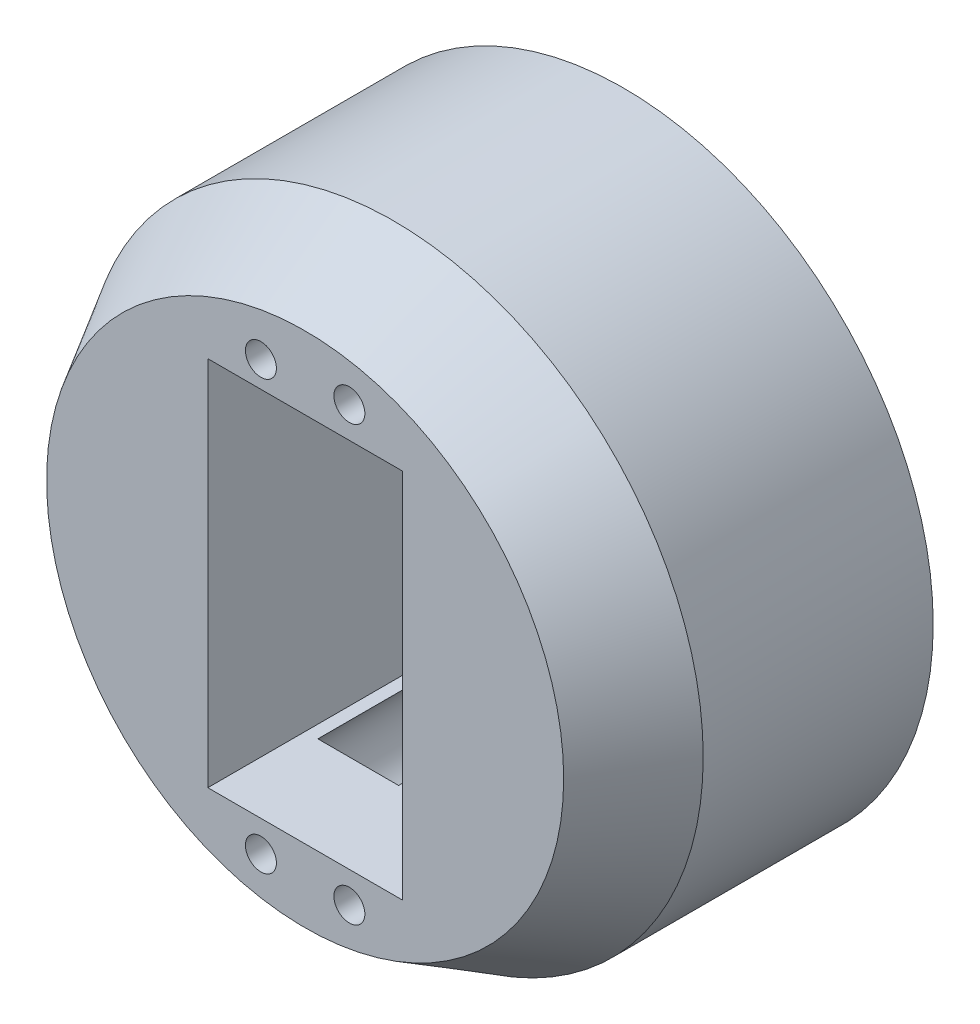
ISO-10303-21;
HEADER;
FILE_DESCRIPTION(('STEP AP214'),'2;1');
FILE_NAME('part.step','',(''),(''),'','','');
FILE_SCHEMA(('AUTOMOTIVE_DESIGN { 1 0 10303 214 1 1 1 1 }'));
ENDSEC;
DATA;
#1=APPLICATION_CONTEXT('core data for automotive mechanical design processes');
#2=APPLICATION_PROTOCOL_DEFINITION('international standard','automotive_design',2000,#1);
#3=PRODUCT_CONTEXT('',#1,'mechanical');
#4=PRODUCT('Part','Part','',(#3));
#5=PRODUCT_RELATED_PRODUCT_CATEGORY('part','',(#4));
#6=PRODUCT_DEFINITION_FORMATION('','',#4);
#7=PRODUCT_DEFINITION_CONTEXT('part definition',#1,'design');
#8=PRODUCT_DEFINITION('design','',#6,#7);
#9=PRODUCT_DEFINITION_SHAPE('','',#8);
#10=(LENGTH_UNIT() NAMED_UNIT(*) SI_UNIT(.MILLI.,.METRE.));
#11=(NAMED_UNIT(*) PLANE_ANGLE_UNIT() SI_UNIT($,.RADIAN.));
#12=(NAMED_UNIT(*) SI_UNIT($,.STERADIAN.) SOLID_ANGLE_UNIT());
#13=UNCERTAINTY_MEASURE_WITH_UNIT(LENGTH_MEASURE(1.E-05),#10,'distance_accuracy_value','');
#14=(GEOMETRIC_REPRESENTATION_CONTEXT(3) GLOBAL_UNCERTAINTY_ASSIGNED_CONTEXT((#13)) GLOBAL_UNIT_ASSIGNED_CONTEXT((#10,
#11,#12)) REPRESENTATION_CONTEXT('',''));
#15=CARTESIAN_POINT('',(0.,0.,0.));
#16=DIRECTION('',(0.,0.,1.));
#17=DIRECTION('',(1.,0.,0.));
#18=AXIS2_PLACEMENT_3D('',#15,#16,#17);
#19=CARTESIAN_POINT('',(0.,0.,0.));
#20=DIRECTION('',(0.,0.,1.));
#21=DIRECTION('',(1.,0.,0.));
#22=AXIS2_PLACEMENT_3D('',#19,#20,#21);
#23=PLANE('',#22);
#24=CARTESIAN_POINT('',(0.,0.,0.));
#25=DIRECTION('',(0.,0.,1.));
#26=DIRECTION('',(1.,0.,0.));
#27=AXIS2_PLACEMENT_3D('',#24,#25,#26);
#28=CIRCLE('',#27,35.);
#29=CARTESIAN_POINT('',(35.,0.,0.));
#30=VERTEX_POINT('',#29);
#31=EDGE_CURVE('E261',#30,#30,#28,.T.);
#32=ORIENTED_EDGE('',*,*,#31,.F.);
#33=EDGE_LOOP('',(#32));
#34=FACE_BOUND('',#33,.T.);
#35=DIRECTION('',(-1.,0.,0.));
#36=VECTOR('',#35,1.);
#37=CARTESIAN_POINT('',(-11.,21.,0.));
#38=LINE('',#37,#36);
#39=CARTESIAN_POINT('',(11.,21.,0.));
#40=VERTEX_POINT('',#39);
#41=CARTESIAN_POINT('',(9.56207189772367,21.,0.));
#42=VERTEX_POINT('',#41);
#43=EDGE_CURVE('E237',#40,#42,#38,.T.);
#44=ORIENTED_EDGE('',*,*,#43,.T.);
#45=CARTESIAN_POINT('',(5.,24.5,0.));
#46=DIRECTION('',(0.,0.,-1.));
#47=DIRECTION('',(-1.,0.,0.));
#48=AXIS2_PLACEMENT_3D('',#45,#46,#47);
#49=CIRCLE('',#48,5.75);
#50=CARTESIAN_POINT('',(-0.161572277524169,27.0339044228017,0.));
#51=VERTEX_POINT('',#50);
#52=EDGE_CURVE('E183',#51,#42,#49,.T.);
#53=ORIENTED_EDGE('',*,*,#52,.F.);
#54=CARTESIAN_POINT('',(-5.,23.9271187568155,0.));
#55=DIRECTION('',(0.,0.,-1.));
#56=DIRECTION('',(-1.,0.,0.));
#57=AXIS2_PLACEMENT_3D('',#54,#55,#56);
#58=CIRCLE('',#57,5.75);
#59=CARTESIAN_POINT('',(-9.94918940671085,21.,0.));
#60=VERTEX_POINT('',#59);
#61=EDGE_CURVE('E185',#60,#51,#58,.T.);
#62=ORIENTED_EDGE('',*,*,#61,.F.);
#63=CARTESIAN_POINT('',(-11.,21.,0.));
#64=VERTEX_POINT('',#63);
#65=EDGE_CURVE('E235',#60,#64,#38,.T.);
#66=ORIENTED_EDGE('',*,*,#65,.T.);
#67=DIRECTION('',(0.,-1.,0.));
#68=VECTOR('',#67,1.);
#69=CARTESIAN_POINT('',(-11.,-21.,0.));
#70=LINE('',#69,#68);
#71=CARTESIAN_POINT('',(-11.,-21.,0.));
#72=VERTEX_POINT('',#71);
#73=EDGE_CURVE('E240',#64,#72,#70,.T.);
#74=ORIENTED_EDGE('',*,*,#73,.T.);
#75=DIRECTION('',(1.,0.,0.));
#76=VECTOR('',#75,1.);
#77=CARTESIAN_POINT('',(-11.,-21.,0.));
#78=LINE('',#77,#76);
#79=CARTESIAN_POINT('',(-9.56207189772366,-21.,0.));
#80=VERTEX_POINT('',#79);
#81=EDGE_CURVE('E245',#72,#80,#78,.T.);
#82=ORIENTED_EDGE('',*,*,#81,.T.);
#83=CARTESIAN_POINT('',(-5.,-24.5,0.));
#84=DIRECTION('',(0.,0.,-1.));
#85=DIRECTION('',(-1.,0.,0.));
#86=AXIS2_PLACEMENT_3D('',#83,#84,#85);
#87=CIRCLE('',#86,5.75);
#88=CARTESIAN_POINT('',(0.,-27.3394541729001,0.));
#89=VERTEX_POINT('',#88);
#90=EDGE_CURVE('E201',#89,#80,#87,.T.);
#91=ORIENTED_EDGE('',*,*,#90,.F.);
#92=CARTESIAN_POINT('',(5.,-24.5,0.));
#93=DIRECTION('',(0.,0.,-1.));
#94=DIRECTION('',(-1.,0.,0.));
#95=AXIS2_PLACEMENT_3D('',#92,#93,#94);
#96=CIRCLE('',#95,5.75);
#97=CARTESIAN_POINT('',(9.56207189772367,-21.,0.));
#98=VERTEX_POINT('',#97);
#99=EDGE_CURVE('E200',#98,#89,#96,.T.);
#100=ORIENTED_EDGE('',*,*,#99,.F.);
#101=CARTESIAN_POINT('',(11.,-21.,0.));
#102=VERTEX_POINT('',#101);
#103=EDGE_CURVE('E244',#98,#102,#78,.T.);
#104=ORIENTED_EDGE('',*,*,#103,.T.);
#105=DIRECTION('',(0.,1.,0.));
#106=VECTOR('',#105,1.);
#107=CARTESIAN_POINT('',(11.,-21.,0.));
#108=LINE('',#107,#106);
#109=EDGE_CURVE('E232',#102,#40,#108,.T.);
#110=ORIENTED_EDGE('',*,*,#109,.T.);
#111=EDGE_LOOP('',(#44,#53,#62,#66,#74,#82,#91,#100,#104,#110));
#112=FACE_BOUND('',#111,.T.);
#113=ADVANCED_FACE('F43',(#34,#112),#23,.F.);
#114=CARTESIAN_POINT('',(0.161572277524159,21.3932143340138,0.));
#115=VERTEX_POINT('',#114);
#116=CARTESIAN_POINT('',(-0.0508105932891592,21.,0.));
#117=VERTEX_POINT('',#116);
#118=EDGE_CURVE('E164',#115,#117,#58,.T.);
#119=ORIENTED_EDGE('',*,*,#118,.F.);
#120=CARTESIAN_POINT('',(0.437928102276328,21.,0.));
#121=VERTEX_POINT('',#120);
#122=EDGE_CURVE('E170',#121,#115,#49,.T.);
#123=ORIENTED_EDGE('',*,*,#122,.F.);
#124=EDGE_CURVE('E241',#121,#117,#38,.T.);
#125=ORIENTED_EDGE('',*,*,#124,.T.);
#126=EDGE_LOOP('',(#119,#123,#125));
#127=FACE_BOUND('',#126,.T.);
#128=ADVANCED_FACE('F351',(#127),#23,.F.);
#129=CARTESIAN_POINT('',(-5.,23.9271187568155,0.));
#130=DIRECTION('',(0.,0.,1.));
#131=DIRECTION('',(1.,0.,0.));
#132=AXIS2_PLACEMENT_3D('',#129,#130,#131);
#133=CYLINDRICAL_SURFACE('',#132,1.75);
#134=CARTESIAN_POINT('',(-5.,23.9271187568155,36.));
#135=DIRECTION('',(0.,0.,1.));
#136=DIRECTION('',(1.,0.,0.));
#137=AXIS2_PLACEMENT_3D('',#134,#135,#136);
#138=CIRCLE('',#137,1.75);
#139=CARTESIAN_POINT('',(-3.25,23.9271187568155,36.));
#140=VERTEX_POINT('',#139);
#141=EDGE_CURVE('E222',#140,#140,#138,.T.);
#142=ORIENTED_EDGE('',*,*,#141,.T.);
#143=EDGE_LOOP('',(#142));
#144=FACE_BOUND('',#143,.T.);
#145=CARTESIAN_POINT('',(-5.,23.9271187568155,25.));
#146=DIRECTION('',(0.,0.,-1.));
#147=DIRECTION('',(-1.,0.,0.));
#148=AXIS2_PLACEMENT_3D('',#145,#146,#147);
#149=CIRCLE('',#148,1.75);
#150=CARTESIAN_POINT('',(-6.75,23.9271187568155,25.));
#151=VERTEX_POINT('',#150);
#152=EDGE_CURVE('E352',#151,#151,#149,.T.);
#153=ORIENTED_EDGE('',*,*,#152,.T.);
#154=EDGE_LOOP('',(#153));
#155=FACE_BOUND('',#154,.T.);
#156=ADVANCED_FACE('F375',(#144,#155),#133,.F.);
#157=CARTESIAN_POINT('',(5.,24.5,0.));
#158=DIRECTION('',(0.,0.,1.));
#159=DIRECTION('',(1.,0.,0.));
#160=AXIS2_PLACEMENT_3D('',#157,#158,#159);
#161=CYLINDRICAL_SURFACE('',#160,1.75);
#162=CARTESIAN_POINT('',(5.,24.5,36.));
#163=DIRECTION('',(0.,0.,1.));
#164=DIRECTION('',(1.,0.,0.));
#165=AXIS2_PLACEMENT_3D('',#162,#163,#164);
#166=CIRCLE('',#165,1.75);
#167=CARTESIAN_POINT('',(6.75,24.5,36.));
#168=VERTEX_POINT('',#167);
#169=EDGE_CURVE('E219',#168,#168,#166,.T.);
#170=ORIENTED_EDGE('',*,*,#169,.T.);
#171=EDGE_LOOP('',(#170));
#172=FACE_BOUND('',#171,.T.);
#173=CARTESIAN_POINT('',(5.,24.5,25.));
#174=DIRECTION('',(0.,0.,-1.));
#175=DIRECTION('',(-1.,0.,0.));
#176=AXIS2_PLACEMENT_3D('',#173,#174,#175);
#177=CIRCLE('',#176,1.75);
#178=CARTESIAN_POINT('',(3.25,24.5,25.));
#179=VERTEX_POINT('',#178);
#180=EDGE_CURVE('E214',#179,#179,#177,.T.);
#181=ORIENTED_EDGE('',*,*,#180,.T.);
#182=EDGE_LOOP('',(#181));
#183=FACE_BOUND('',#182,.T.);
#184=ADVANCED_FACE('F360',(#172,#183),#161,.F.);
#185=CARTESIAN_POINT('',(5.,-24.5,0.));
#186=DIRECTION('',(0.,0.,1.));
#187=DIRECTION('',(1.,0.,0.));
#188=AXIS2_PLACEMENT_3D('',#185,#186,#187);
#189=CYLINDRICAL_SURFACE('',#188,1.75);
#190=CARTESIAN_POINT('',(5.,-24.5,36.));
#191=DIRECTION('',(0.,0.,1.));
#192=DIRECTION('',(1.,0.,0.));
#193=AXIS2_PLACEMENT_3D('',#190,#191,#192);
#194=CIRCLE('',#193,1.75);
#195=CARTESIAN_POINT('',(6.75,-24.5,36.));
#196=VERTEX_POINT('',#195);
#197=EDGE_CURVE('E223',#196,#196,#194,.T.);
#198=ORIENTED_EDGE('',*,*,#197,.T.);
#199=EDGE_LOOP('',(#198));
#200=FACE_BOUND('',#199,.T.);
#201=CARTESIAN_POINT('',(5.,-24.5,25.));
#202=DIRECTION('',(0.,0.,-1.));
#203=DIRECTION('',(-1.,0.,0.));
#204=AXIS2_PLACEMENT_3D('',#201,#202,#203);
#205=CIRCLE('',#204,1.75);
#206=CARTESIAN_POINT('',(3.25,-24.5,25.));
#207=VERTEX_POINT('',#206);
#208=EDGE_CURVE('E203',#207,#207,#205,.T.);
#209=ORIENTED_EDGE('',*,*,#208,.T.);
#210=EDGE_LOOP('',(#209));
#211=FACE_BOUND('',#210,.T.);
#212=ADVANCED_FACE('F407',(#200,#211),#189,.F.);
#213=CARTESIAN_POINT('',(-5.,-24.5,0.));
#214=DIRECTION('',(0.,0.,1.));
#215=DIRECTION('',(1.,0.,0.));
#216=AXIS2_PLACEMENT_3D('',#213,#214,#215);
#217=CYLINDRICAL_SURFACE('',#216,1.75);
#218=CARTESIAN_POINT('',(-5.,-24.5,36.));
#219=DIRECTION('',(0.,0.,1.));
#220=DIRECTION('',(1.,0.,0.));
#221=AXIS2_PLACEMENT_3D('',#218,#219,#220);
#222=CIRCLE('',#221,1.75);
#223=CARTESIAN_POINT('',(-3.25,-24.5,36.));
#224=VERTEX_POINT('',#223);
#225=EDGE_CURVE('E226',#224,#224,#222,.T.);
#226=ORIENTED_EDGE('',*,*,#225,.T.);
#227=EDGE_LOOP('',(#226));
#228=FACE_BOUND('',#227,.T.);
#229=CARTESIAN_POINT('',(-5.,-24.5,25.));
#230=DIRECTION('',(0.,0.,-1.));
#231=DIRECTION('',(-1.,0.,0.));
#232=AXIS2_PLACEMENT_3D('',#229,#230,#231);
#233=CIRCLE('',#232,1.75);
#234=CARTESIAN_POINT('',(-6.75,-24.5,25.));
#235=VERTEX_POINT('',#234);
#236=EDGE_CURVE('E211',#235,#235,#233,.T.);
#237=ORIENTED_EDGE('',*,*,#236,.T.);
#238=EDGE_LOOP('',(#237));
#239=FACE_BOUND('',#238,.T.);
#240=ADVANCED_FACE('F389',(#228,#239),#217,.F.);
#241=CARTESIAN_POINT('',(0.,0.,36.));
#242=DIRECTION('',(0.,0.,-1.));
#243=DIRECTION('',(-1.,0.,0.));
#244=AXIS2_PLACEMENT_3D('',#241,#242,#243);
#245=CYLINDRICAL_SURFACE('',#244,35.);
#246=CARTESIAN_POINT('',(0.,0.,25.9999999999999));
#247=DIRECTION('',(0.,0.,1.));
#248=DIRECTION('',(1.,0.,0.));
#249=AXIS2_PLACEMENT_3D('',#246,#247,#248);
#250=CIRCLE('',#249,35.);
#251=CARTESIAN_POINT('',(35.,0.,25.9999999999999));
#252=VERTEX_POINT('',#251);
#253=EDGE_CURVE('E273',#252,#252,#250,.F.);
#254=ORIENTED_EDGE('',*,*,#253,.T.);
#255=EDGE_LOOP('',(#254));
#256=FACE_BOUND('',#255,.T.);
#257=ORIENTED_EDGE('',*,*,#31,.T.);
#258=EDGE_LOOP('',(#257));
#259=FACE_BOUND('',#258,.T.);
#260=ADVANCED_FACE('F384',(#256,#259),#245,.T.);
#261=CARTESIAN_POINT('',(0.,0.,36.));
#262=DIRECTION('',(0.,0.,1.));
#263=DIRECTION('',(1.,0.,0.));
#264=AXIS2_PLACEMENT_3D('',#261,#262,#263);
#265=PLANE('',#264);
#266=ORIENTED_EDGE('',*,*,#225,.F.);
#267=EDGE_LOOP('',(#266));
#268=FACE_BOUND('',#267,.T.);
#269=ORIENTED_EDGE('',*,*,#197,.F.);
#270=EDGE_LOOP('',(#269));
#271=FACE_BOUND('',#270,.T.);
#272=ORIENTED_EDGE('',*,*,#169,.F.);
#273=EDGE_LOOP('',(#272));
#274=FACE_BOUND('',#273,.T.);
#275=ORIENTED_EDGE('',*,*,#141,.F.);
#276=EDGE_LOOP('',(#275));
#277=FACE_BOUND('',#276,.T.);
#278=DIRECTION('',(0.,1.,0.));
#279=VECTOR('',#278,1.);
#280=CARTESIAN_POINT('',(11.,-21.,36.));
#281=LINE('',#280,#279);
#282=CARTESIAN_POINT('',(11.,-21.,36.));
#283=VERTEX_POINT('',#282);
#284=CARTESIAN_POINT('',(11.,21.,36.));
#285=VERTEX_POINT('',#284);
#286=EDGE_CURVE('E231',#283,#285,#281,.T.);
#287=ORIENTED_EDGE('',*,*,#286,.F.);
#288=DIRECTION('',(1.,0.,0.));
#289=VECTOR('',#288,1.);
#290=CARTESIAN_POINT('',(-11.,-21.,36.));
#291=LINE('',#290,#289);
#292=CARTESIAN_POINT('',(-11.,-21.,36.));
#293=VERTEX_POINT('',#292);
#294=EDGE_CURVE('E236',#293,#283,#291,.T.);
#295=ORIENTED_EDGE('',*,*,#294,.F.);
#296=DIRECTION('',(0.,-1.,0.));
#297=VECTOR('',#296,1.);
#298=CARTESIAN_POINT('',(-11.,-21.,36.));
#299=LINE('',#298,#297);
#300=CARTESIAN_POINT('',(-11.,21.,36.));
#301=VERTEX_POINT('',#300);
#302=EDGE_CURVE('E254',#301,#293,#299,.T.);
#303=ORIENTED_EDGE('',*,*,#302,.F.);
#304=DIRECTION('',(-1.,0.,0.));
#305=VECTOR('',#304,1.);
#306=CARTESIAN_POINT('',(-11.,21.,36.));
#307=LINE('',#306,#305);
#308=EDGE_CURVE('E251',#285,#301,#307,.T.);
#309=ORIENTED_EDGE('',*,*,#308,.F.);
#310=EDGE_LOOP('',(#287,#295,#303,#309));
#311=FACE_BOUND('',#310,.T.);
#312=CARTESIAN_POINT('',(0.,0.,36.));
#313=DIRECTION('',(0.,0.,1.));
#314=DIRECTION('',(1.,0.,0.));
#315=AXIS2_PLACEMENT_3D('',#312,#313,#314);
#316=CIRCLE('',#315,29.2264973081037);
#317=CARTESIAN_POINT('',(29.2264973081037,0.,36.));
#318=VERTEX_POINT('',#317);
#319=EDGE_CURVE('E270',#318,#318,#316,.T.);
#320=ORIENTED_EDGE('',*,*,#319,.T.);
#321=EDGE_LOOP('',(#320));
#322=FACE_BOUND('',#321,.T.);
#323=ADVANCED_FACE('F334',(#268,#271,#274,#277,#311,#322),#265,.T.);
#324=CARTESIAN_POINT('',(0.,-21.6605458270999,0.));
#325=VERTEX_POINT('',#324);
#326=CARTESIAN_POINT('',(0.437928102276337,-21.,0.));
#327=VERTEX_POINT('',#326);
#328=EDGE_CURVE('E197',#325,#327,#96,.T.);
#329=ORIENTED_EDGE('',*,*,#328,.F.);
#330=CARTESIAN_POINT('',(-0.437928102276332,-21.,0.));
#331=VERTEX_POINT('',#330);
#332=EDGE_CURVE('E199',#331,#325,#87,.T.);
#333=ORIENTED_EDGE('',*,*,#332,.F.);
#334=EDGE_CURVE('E249',#331,#327,#78,.T.);
#335=ORIENTED_EDGE('',*,*,#334,.T.);
#336=EDGE_LOOP('',(#329,#333,#335));
#337=FACE_BOUND('',#336,.T.);
#338=ADVANCED_FACE('F303',(#337),#23,.F.);
#339=CARTESIAN_POINT('',(0.,0.,36.));
#340=DIRECTION('',(0.,0.,-1.));
#341=DIRECTION('',(-1.,0.,0.));
#342=AXIS2_PLACEMENT_3D('',#339,#340,#341);
#343=CONICAL_SURFACE('',#342,29.2264973081037,0.523598775598297);
#344=ORIENTED_EDGE('',*,*,#253,.F.);
#345=EDGE_LOOP('',(#344));
#346=FACE_BOUND('',#345,.T.);
#347=ORIENTED_EDGE('',*,*,#319,.F.);
#348=EDGE_LOOP('',(#347));
#349=FACE_BOUND('',#348,.T.);
#350=ADVANCED_FACE('F46',(#346,#349),#343,.T.);
#351=CARTESIAN_POINT('',(11.,-21.,0.));
#352=DIRECTION('',(1.,0.,0.));
#353=DIRECTION('',(0.,0.,-1.));
#354=AXIS2_PLACEMENT_3D('',#351,#352,#353);
#355=PLANE('',#354);
#356=ORIENTED_EDGE('',*,*,#286,.T.);
#357=DIRECTION('',(0.,0.,1.));
#358=VECTOR('',#357,1.);
#359=CARTESIAN_POINT('',(11.,21.,0.));
#360=LINE('',#359,#358);
#361=EDGE_CURVE('E248',#40,#285,#360,.T.);
#362=ORIENTED_EDGE('',*,*,#361,.F.);
#363=ORIENTED_EDGE('',*,*,#109,.F.);
#364=DIRECTION('',(0.,0.,1.));
#365=VECTOR('',#364,1.);
#366=CARTESIAN_POINT('',(11.,-21.,0.));
#367=LINE('',#366,#365);
#368=EDGE_CURVE('E259',#102,#283,#367,.T.);
#369=ORIENTED_EDGE('',*,*,#368,.T.);
#370=EDGE_LOOP('',(#356,#362,#363,#369));
#371=FACE_BOUND('',#370,.T.);
#372=ADVANCED_FACE('F339',(#371),#355,.F.);
#373=CARTESIAN_POINT('',(-11.,-21.,0.));
#374=DIRECTION('',(0.,-1.,0.));
#375=DIRECTION('',(0.,0.,-1.));
#376=AXIS2_PLACEMENT_3D('',#373,#374,#375);
#377=PLANE('',#376);
#378=DIRECTION('',(1.,0.,0.));
#379=VECTOR('',#378,1.);
#380=CARTESIAN_POINT('',(-11.,-21.,25.));
#381=LINE('',#380,#379);
#382=CARTESIAN_POINT('',(-9.56207189772366,-21.,25.));
#383=VERTEX_POINT('',#382);
#384=CARTESIAN_POINT('',(-0.437928102276332,-21.,25.));
#385=VERTEX_POINT('',#384);
#386=EDGE_CURVE('E216',#383,#385,#381,.T.);
#387=ORIENTED_EDGE('',*,*,#386,.F.);
#388=DIRECTION('',(0.,0.,-1.));
#389=VECTOR('',#388,1.);
#390=CARTESIAN_POINT('',(-9.56207189772366,-21.,25.));
#391=LINE('',#390,#389);
#392=EDGE_CURVE('E12',#383,#80,#391,.T.);
#393=ORIENTED_EDGE('',*,*,#392,.T.);
#394=ORIENTED_EDGE('',*,*,#81,.F.);
#395=DIRECTION('',(0.,0.,1.));
#396=VECTOR('',#395,1.);
#397=CARTESIAN_POINT('',(-11.,-21.,0.));
#398=LINE('',#397,#396);
#399=EDGE_CURVE('E262',#72,#293,#398,.T.);
#400=ORIENTED_EDGE('',*,*,#399,.T.);
#401=ORIENTED_EDGE('',*,*,#294,.T.);
#402=ORIENTED_EDGE('',*,*,#368,.F.);
#403=ORIENTED_EDGE('',*,*,#103,.F.);
#404=DIRECTION('',(0.,0.,-1.));
#405=VECTOR('',#404,1.);
#406=CARTESIAN_POINT('',(9.56207189772367,-21.,25.));
#407=LINE('',#406,#405);
#408=CARTESIAN_POINT('',(9.56207189772367,-21.,25.));
#409=VERTEX_POINT('',#408);
#410=EDGE_CURVE('E285',#98,#409,#407,.F.);
#411=ORIENTED_EDGE('',*,*,#410,.T.);
#412=CARTESIAN_POINT('',(0.437928102276337,-21.,25.));
#413=VERTEX_POINT('',#412);
#414=EDGE_CURVE('E188',#413,#409,#381,.T.);
#415=ORIENTED_EDGE('',*,*,#414,.F.);
#416=DIRECTION('',(0.,0.,-1.));
#417=VECTOR('',#416,1.);
#418=CARTESIAN_POINT('',(0.437928102276337,-21.,25.));
#419=LINE('',#418,#417);
#420=EDGE_CURVE('E288',#413,#327,#419,.T.);
#421=ORIENTED_EDGE('',*,*,#420,.T.);
#422=ORIENTED_EDGE('',*,*,#334,.F.);
#423=DIRECTION('',(0.,0.,-1.));
#424=VECTOR('',#423,1.);
#425=CARTESIAN_POINT('',(-0.437928102276332,-21.,25.));
#426=LINE('',#425,#424);
#427=EDGE_CURVE('E52',#331,#385,#426,.F.);
#428=ORIENTED_EDGE('',*,*,#427,.T.);
#429=EDGE_LOOP('',(#387,#393,#394,#400,#401,#402,#403,#411,#415,#421,#422,#428));
#430=FACE_BOUND('',#429,.T.);
#431=ADVANCED_FACE('F294',(#430),#377,.F.);
#432=CARTESIAN_POINT('',(-11.,-21.,0.));
#433=DIRECTION('',(-1.,0.,0.));
#434=DIRECTION('',(0.,0.,1.));
#435=AXIS2_PLACEMENT_3D('',#432,#433,#434);
#436=PLANE('',#435);
#437=ORIENTED_EDGE('',*,*,#302,.T.);
#438=ORIENTED_EDGE('',*,*,#399,.F.);
#439=ORIENTED_EDGE('',*,*,#73,.F.);
#440=DIRECTION('',(0.,0.,1.));
#441=VECTOR('',#440,1.);
#442=CARTESIAN_POINT('',(-11.,21.,0.));
#443=LINE('',#442,#441);
#444=EDGE_CURVE('E264',#64,#301,#443,.T.);
#445=ORIENTED_EDGE('',*,*,#444,.T.);
#446=EDGE_LOOP('',(#437,#438,#439,#445));
#447=FACE_BOUND('',#446,.T.);
#448=ADVANCED_FACE('F325',(#447),#436,.F.);
#449=CARTESIAN_POINT('',(-11.,21.,0.));
#450=DIRECTION('',(0.,1.,0.));
#451=DIRECTION('',(0.,0.,1.));
#452=AXIS2_PLACEMENT_3D('',#449,#450,#451);
#453=PLANE('',#452);
#454=DIRECTION('',(-1.,0.,0.));
#455=VECTOR('',#454,1.);
#456=CARTESIAN_POINT('',(-11.,21.,25.));
#457=LINE('',#456,#455);
#458=CARTESIAN_POINT('',(9.56207189772367,21.,25.));
#459=VERTEX_POINT('',#458);
#460=CARTESIAN_POINT('',(0.437928102276328,21.,25.));
#461=VERTEX_POINT('',#460);
#462=EDGE_CURVE('E160',#459,#461,#457,.T.);
#463=ORIENTED_EDGE('',*,*,#462,.F.);
#464=DIRECTION('',(0.,0.,-1.));
#465=VECTOR('',#464,1.);
#466=CARTESIAN_POINT('',(9.56207189772367,21.,25.));
#467=LINE('',#466,#465);
#468=EDGE_CURVE('E282',#459,#42,#467,.T.);
#469=ORIENTED_EDGE('',*,*,#468,.T.);
#470=ORIENTED_EDGE('',*,*,#43,.F.);
#471=ORIENTED_EDGE('',*,*,#361,.T.);
#472=ORIENTED_EDGE('',*,*,#308,.T.);
#473=ORIENTED_EDGE('',*,*,#444,.F.);
#474=ORIENTED_EDGE('',*,*,#65,.F.);
#475=DIRECTION('',(0.,0.,-1.));
#476=VECTOR('',#475,1.);
#477=CARTESIAN_POINT('',(-9.94918940671085,21.,25.));
#478=LINE('',#477,#476);
#479=CARTESIAN_POINT('',(-9.94918940671085,21.,25.));
#480=VERTEX_POINT('',#479);
#481=EDGE_CURVE('E276',#60,#480,#478,.F.);
#482=ORIENTED_EDGE('',*,*,#481,.T.);
#483=CARTESIAN_POINT('',(-0.0508105932891592,21.,25.));
#484=VERTEX_POINT('',#483);
#485=EDGE_CURVE('E217',#484,#480,#457,.T.);
#486=ORIENTED_EDGE('',*,*,#485,.F.);
#487=DIRECTION('',(0.,0.,-1.));
#488=VECTOR('',#487,1.);
#489=CARTESIAN_POINT('',(-0.0508105932891592,21.,25.));
#490=LINE('',#489,#488);
#491=EDGE_CURVE('E177',#484,#117,#490,.T.);
#492=ORIENTED_EDGE('',*,*,#491,.T.);
#493=ORIENTED_EDGE('',*,*,#124,.F.);
#494=DIRECTION('',(0.,0.,-1.));
#495=VECTOR('',#494,1.);
#496=CARTESIAN_POINT('',(0.437928102276328,21.,25.));
#497=LINE('',#496,#495);
#498=EDGE_CURVE('E280',#121,#461,#497,.F.);
#499=ORIENTED_EDGE('',*,*,#498,.T.);
#500=EDGE_LOOP('',(#463,#469,#470,#471,#472,#473,#474,#482,#486,#492,#493,#499));
#501=FACE_BOUND('',#500,.T.);
#502=ADVANCED_FACE('F327',(#501),#453,.F.);
#503=CARTESIAN_POINT('',(-5.,-24.5,25.));
#504=DIRECTION('',(0.,0.,-1.));
#505=DIRECTION('',(-1.,0.,0.));
#506=AXIS2_PLACEMENT_3D('',#503,#504,#505);
#507=CYLINDRICAL_SURFACE('',#506,5.75);
#508=CARTESIAN_POINT('',(-5.,-24.5,25.));
#509=DIRECTION('',(0.,0.,-1.));
#510=DIRECTION('',(-1.,0.,0.));
#511=AXIS2_PLACEMENT_3D('',#508,#509,#510);
#512=CIRCLE('',#511,5.75);
#513=CARTESIAN_POINT('',(0.,-27.3394541729001,25.));
#514=VERTEX_POINT('',#513);
#515=EDGE_CURVE('E206',#514,#383,#512,.T.);
#516=ORIENTED_EDGE('',*,*,#515,.F.);
#517=DIRECTION('',(0.,0.,-1.));
#518=VECTOR('',#517,1.);
#519=CARTESIAN_POINT('',(0.,-27.3394541729001,25.));
#520=LINE('',#519,#518);
#521=EDGE_CURVE('E194',#514,#89,#520,.T.);
#522=ORIENTED_EDGE('',*,*,#521,.T.);
#523=ORIENTED_EDGE('',*,*,#90,.T.);
#524=ORIENTED_EDGE('',*,*,#392,.F.);
#525=EDGE_LOOP('',(#516,#522,#523,#524));
#526=FACE_BOUND('',#525,.T.);
#527=ADVANCED_FACE('F317',(#526),#507,.F.);
#528=ORIENTED_EDGE('',*,*,#332,.T.);
#529=DIRECTION('',(0.,0.,-1.));
#530=VECTOR('',#529,1.);
#531=CARTESIAN_POINT('',(0.,-21.6605458270999,25.));
#532=LINE('',#531,#530);
#533=CARTESIAN_POINT('',(0.,-21.6605458270999,25.));
#534=VERTEX_POINT('',#533);
#535=EDGE_CURVE('E190',#534,#325,#532,.T.);
#536=ORIENTED_EDGE('',*,*,#535,.F.);
#537=EDGE_CURVE('E205',#385,#534,#512,.T.);
#538=ORIENTED_EDGE('',*,*,#537,.F.);
#539=ORIENTED_EDGE('',*,*,#427,.F.);
#540=EDGE_LOOP('',(#528,#536,#538,#539));
#541=FACE_BOUND('',#540,.T.);
#542=ADVANCED_FACE('F299',(#541),#507,.F.);
#543=CARTESIAN_POINT('',(5.,-24.5,25.));
#544=DIRECTION('',(0.,0.,-1.));
#545=DIRECTION('',(-1.,0.,0.));
#546=AXIS2_PLACEMENT_3D('',#543,#544,#545);
#547=CYLINDRICAL_SURFACE('',#546,5.75);
#548=CARTESIAN_POINT('',(5.,-24.5,25.));
#549=DIRECTION('',(0.,0.,-1.));
#550=DIRECTION('',(-1.,0.,0.));
#551=AXIS2_PLACEMENT_3D('',#548,#549,#550);
#552=CIRCLE('',#551,5.75);
#553=EDGE_CURVE('E59',#534,#413,#552,.T.);
#554=ORIENTED_EDGE('',*,*,#553,.F.);
#555=ORIENTED_EDGE('',*,*,#535,.T.);
#556=ORIENTED_EDGE('',*,*,#328,.T.);
#557=ORIENTED_EDGE('',*,*,#420,.F.);
#558=EDGE_LOOP('',(#554,#555,#556,#557));
#559=FACE_BOUND('',#558,.T.);
#560=ADVANCED_FACE('F305',(#559),#547,.F.);
#561=ORIENTED_EDGE('',*,*,#99,.T.);
#562=ORIENTED_EDGE('',*,*,#521,.F.);
#563=EDGE_CURVE('E193',#409,#514,#552,.T.);
#564=ORIENTED_EDGE('',*,*,#563,.F.);
#565=ORIENTED_EDGE('',*,*,#410,.F.);
#566=EDGE_LOOP('',(#561,#562,#564,#565));
#567=FACE_BOUND('',#566,.T.);
#568=ADVANCED_FACE('F312',(#567),#547,.F.);
#569=CARTESIAN_POINT('',(0.,-24.5,25.));
#570=DIRECTION('',(0.,0.,-1.));
#571=DIRECTION('',(-1.,0.,0.));
#572=AXIS2_PLACEMENT_3D('',#569,#570,#571);
#573=PLANE('',#572);
#574=ORIENTED_EDGE('',*,*,#236,.F.);
#575=EDGE_LOOP('',(#574));
#576=FACE_BOUND('',#575,.T.);
#577=ORIENTED_EDGE('',*,*,#208,.F.);
#578=EDGE_LOOP('',(#577));
#579=FACE_BOUND('',#578,.T.);
#580=ORIENTED_EDGE('',*,*,#386,.T.);
#581=ORIENTED_EDGE('',*,*,#537,.T.);
#582=ORIENTED_EDGE('',*,*,#553,.T.);
#583=ORIENTED_EDGE('',*,*,#414,.T.);
#584=ORIENTED_EDGE('',*,*,#563,.T.);
#585=ORIENTED_EDGE('',*,*,#515,.T.);
#586=EDGE_LOOP('',(#580,#581,#582,#583,#584,#585));
#587=FACE_BOUND('',#586,.T.);
#588=ADVANCED_FACE('F309',(#576,#579,#587),#573,.T.);
#589=CARTESIAN_POINT('',(5.,24.5,25.));
#590=DIRECTION('',(0.,0.,-1.));
#591=DIRECTION('',(-1.,0.,0.));
#592=AXIS2_PLACEMENT_3D('',#589,#590,#591);
#593=CYLINDRICAL_SURFACE('',#592,5.75);
#594=CARTESIAN_POINT('',(5.,24.5,25.));
#595=DIRECTION('',(0.,0.,-1.));
#596=DIRECTION('',(-1.,0.,0.));
#597=AXIS2_PLACEMENT_3D('',#594,#595,#596);
#598=CIRCLE('',#597,5.75);
#599=CARTESIAN_POINT('',(-0.161572277524169,27.0339044228017,25.));
#600=VERTEX_POINT('',#599);
#601=EDGE_CURVE('E163',#600,#459,#598,.T.);
#602=ORIENTED_EDGE('',*,*,#601,.F.);
#603=DIRECTION('',(0.,0.,-1.));
#604=VECTOR('',#603,1.);
#605=CARTESIAN_POINT('',(-0.161572277524169,27.0339044228017,25.));
#606=LINE('',#605,#604);
#607=EDGE_CURVE('E173',#600,#51,#606,.T.);
#608=ORIENTED_EDGE('',*,*,#607,.T.);
#609=ORIENTED_EDGE('',*,*,#52,.T.);
#610=ORIENTED_EDGE('',*,*,#468,.F.);
#611=EDGE_LOOP('',(#602,#608,#609,#610));
#612=FACE_BOUND('',#611,.T.);
#613=ADVANCED_FACE('F343',(#612),#593,.F.);
#614=ORIENTED_EDGE('',*,*,#122,.T.);
#615=DIRECTION('',(0.,0.,-1.));
#616=VECTOR('',#615,1.);
#617=CARTESIAN_POINT('',(0.161572277524159,21.3932143340138,25.));
#618=LINE('',#617,#616);
#619=CARTESIAN_POINT('',(0.161572277524159,21.3932143340138,25.));
#620=VERTEX_POINT('',#619);
#621=EDGE_CURVE('E167',#620,#115,#618,.T.);
#622=ORIENTED_EDGE('',*,*,#621,.F.);
#623=EDGE_CURVE('E155',#461,#620,#598,.T.);
#624=ORIENTED_EDGE('',*,*,#623,.F.);
#625=ORIENTED_EDGE('',*,*,#498,.F.);
#626=EDGE_LOOP('',(#614,#622,#624,#625));
#627=FACE_BOUND('',#626,.T.);
#628=ADVANCED_FACE('F168',(#627),#593,.F.);
#629=CARTESIAN_POINT('',(-5.,23.9271187568155,25.));
#630=DIRECTION('',(0.,0.,-1.));
#631=DIRECTION('',(-1.,0.,0.));
#632=AXIS2_PLACEMENT_3D('',#629,#630,#631);
#633=CYLINDRICAL_SURFACE('',#632,5.75);
#634=CARTESIAN_POINT('',(-5.,23.9271187568155,25.));
#635=DIRECTION('',(0.,0.,-1.));
#636=DIRECTION('',(-1.,0.,0.));
#637=AXIS2_PLACEMENT_3D('',#634,#635,#636);
#638=CIRCLE('',#637,5.75);
#639=EDGE_CURVE('E67',#620,#484,#638,.T.);
#640=ORIENTED_EDGE('',*,*,#639,.F.);
#641=ORIENTED_EDGE('',*,*,#621,.T.);
#642=ORIENTED_EDGE('',*,*,#118,.T.);
#643=ORIENTED_EDGE('',*,*,#491,.F.);
#644=EDGE_LOOP('',(#640,#641,#642,#643));
#645=FACE_BOUND('',#644,.T.);
#646=ADVANCED_FACE('F175',(#645),#633,.F.);
#647=ORIENTED_EDGE('',*,*,#61,.T.);
#648=ORIENTED_EDGE('',*,*,#607,.F.);
#649=EDGE_CURVE('E179',#480,#600,#638,.T.);
#650=ORIENTED_EDGE('',*,*,#649,.F.);
#651=ORIENTED_EDGE('',*,*,#481,.F.);
#652=EDGE_LOOP('',(#647,#648,#650,#651));
#653=FACE_BOUND('',#652,.T.);
#654=ADVANCED_FACE('F347',(#653),#633,.F.);
#655=CARTESIAN_POINT('',(0.,24.2135593784078,25.));
#656=DIRECTION('',(0.,0.,-1.));
#657=DIRECTION('',(-1.,0.,0.));
#658=AXIS2_PLACEMENT_3D('',#655,#656,#657);
#659=PLANE('',#658);
#660=ORIENTED_EDGE('',*,*,#180,.F.);
#661=EDGE_LOOP('',(#660));
#662=FACE_BOUND('',#661,.T.);
#663=ORIENTED_EDGE('',*,*,#152,.F.);
#664=EDGE_LOOP('',(#663));
#665=FACE_BOUND('',#664,.T.);
#666=ORIENTED_EDGE('',*,*,#462,.T.);
#667=ORIENTED_EDGE('',*,*,#623,.T.);
#668=ORIENTED_EDGE('',*,*,#639,.T.);
#669=ORIENTED_EDGE('',*,*,#485,.T.);
#670=ORIENTED_EDGE('',*,*,#649,.T.);
#671=ORIENTED_EDGE('',*,*,#601,.T.);
#672=EDGE_LOOP('',(#666,#667,#668,#669,#670,#671));
#673=FACE_BOUND('',#672,.T.);
#674=ADVANCED_FACE('F157',(#662,#665,#673),#659,.T.);
#675=CLOSED_SHELL('',(#113,#128,#156,#184,#212,#240,#260,#323,#338,#350,#372,#431,#448,#502,
#527,#542,#560,#568,#588,#613,#628,#646,#654,#674));
#676=MANIFOLD_SOLID_BREP('B2',#675);
#677=ADVANCED_BREP_SHAPE_REPRESENTATION('',(#18,#676),#14);
#678=SHAPE_DEFINITION_REPRESENTATION(#9,#677);
ENDSEC;
END-ISO-10303-21;
